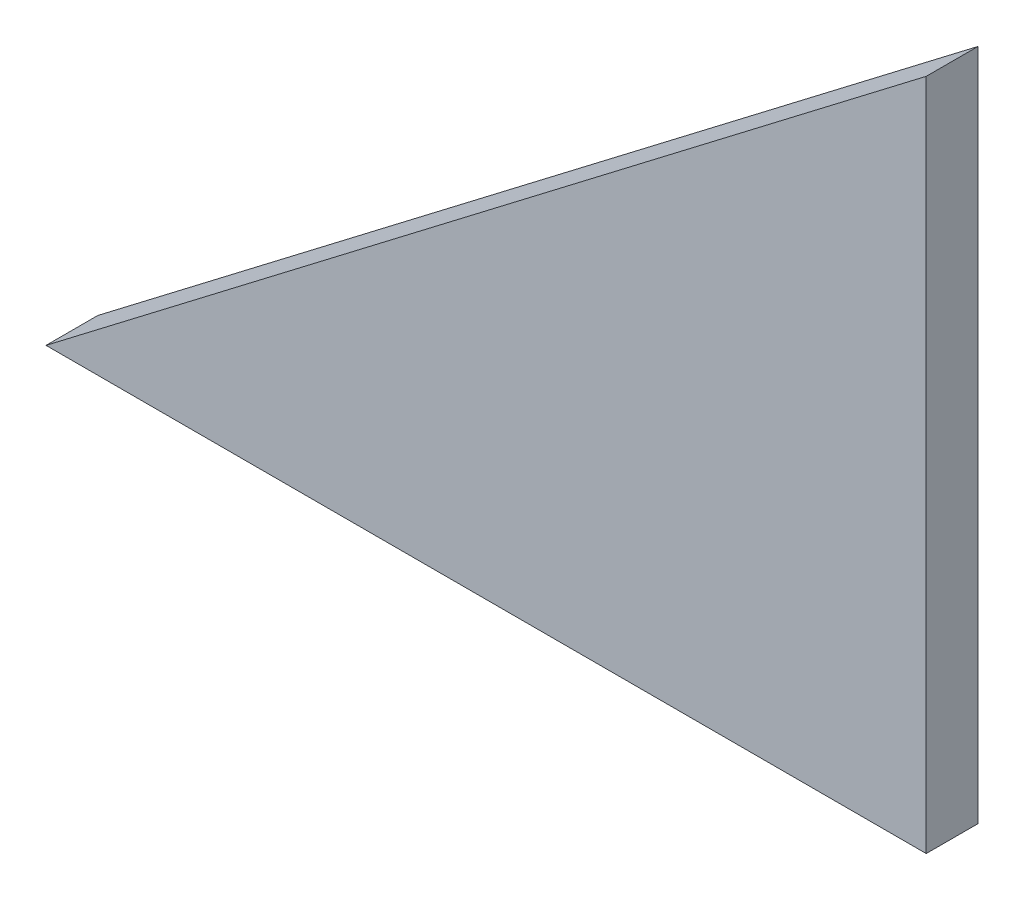
ISO-10303-21;
HEADER;
FILE_DESCRIPTION(('STEP AP214'),'2;1');
FILE_NAME('part.step','',(''),(''),'','','');
FILE_SCHEMA(('AUTOMOTIVE_DESIGN { 1 0 10303 214 1 1 1 1 }'));
ENDSEC;
DATA;
#1=APPLICATION_CONTEXT('core data for automotive mechanical design processes');
#2=APPLICATION_PROTOCOL_DEFINITION('international standard','automotive_design',2000,#1);
#3=PRODUCT_CONTEXT('',#1,'mechanical');
#4=PRODUCT('Part','Part','',(#3));
#5=PRODUCT_RELATED_PRODUCT_CATEGORY('part','',(#4));
#6=PRODUCT_DEFINITION_FORMATION('','',#4);
#7=PRODUCT_DEFINITION_CONTEXT('part definition',#1,'design');
#8=PRODUCT_DEFINITION('design','',#6,#7);
#9=PRODUCT_DEFINITION_SHAPE('','',#8);
#10=(LENGTH_UNIT() NAMED_UNIT(*) SI_UNIT(.MILLI.,.METRE.));
#11=(NAMED_UNIT(*) PLANE_ANGLE_UNIT() SI_UNIT($,.RADIAN.));
#12=(NAMED_UNIT(*) SI_UNIT($,.STERADIAN.) SOLID_ANGLE_UNIT());
#13=UNCERTAINTY_MEASURE_WITH_UNIT(LENGTH_MEASURE(1.E-05),#10,'distance_accuracy_value','');
#14=(GEOMETRIC_REPRESENTATION_CONTEXT(3) GLOBAL_UNCERTAINTY_ASSIGNED_CONTEXT((#13)) GLOBAL_UNIT_ASSIGNED_CONTEXT((#10,
#11,#12)) REPRESENTATION_CONTEXT('',''));
#15=CARTESIAN_POINT('',(0.,0.,0.));
#16=DIRECTION('',(0.,0.,1.));
#17=DIRECTION('',(1.,0.,0.));
#18=AXIS2_PLACEMENT_3D('',#15,#16,#17);
#19=CARTESIAN_POINT('',(170.,130.,-10.));
#20=DIRECTION('',(-0.607450107570797,0.794357832977196,0.));
#21=DIRECTION('',(-0.794357832977196,-0.607450107570797,0.));
#22=AXIS2_PLACEMENT_3D('',#19,#20,#21);
#23=PLANE('',#22);
#24=DIRECTION('',(-0.794357832977196,-0.607450107570797,0.));
#25=VECTOR('',#24,1.);
#26=CARTESIAN_POINT('',(170.,130.,0.));
#27=LINE('',#26,#25);
#28=CARTESIAN_POINT('',(170.,130.,0.));
#29=VERTEX_POINT('',#28);
#30=CARTESIAN_POINT('',(0.,0.,0.));
#31=VERTEX_POINT('',#30);
#32=EDGE_CURVE('E90',#29,#31,#27,.T.);
#33=ORIENTED_EDGE('',*,*,#32,.F.);
#34=DIRECTION('',(0.,0.,1.));
#35=VECTOR('',#34,1.);
#36=CARTESIAN_POINT('',(170.,130.,-10.));
#37=LINE('',#36,#35);
#38=CARTESIAN_POINT('',(170.,130.,-10.));
#39=VERTEX_POINT('',#38);
#40=EDGE_CURVE('E11',#39,#29,#37,.T.);
#41=ORIENTED_EDGE('',*,*,#40,.F.);
#42=DIRECTION('',(-0.794357832977196,-0.607450107570797,0.));
#43=VECTOR('',#42,1.);
#44=CARTESIAN_POINT('',(170.,130.,-10.));
#45=LINE('',#44,#43);
#46=CARTESIAN_POINT('',(0.,0.,-10.));
#47=VERTEX_POINT('',#46);
#48=EDGE_CURVE('E82',#39,#47,#45,.T.);
#49=ORIENTED_EDGE('',*,*,#48,.T.);
#50=DIRECTION('',(0.,0.,1.));
#51=VECTOR('',#50,1.);
#52=CARTESIAN_POINT('',(0.,0.,-10.));
#53=LINE('',#52,#51);
#54=EDGE_CURVE('E41',#47,#31,#53,.T.);
#55=ORIENTED_EDGE('',*,*,#54,.T.);
#56=EDGE_LOOP('',(#33,#41,#49,#55));
#57=FACE_BOUND('',#56,.T.);
#58=ADVANCED_FACE('F38',(#57),#23,.T.);
#59=CARTESIAN_POINT('',(170.,0.,-10.));
#60=DIRECTION('',(1.,0.,0.));
#61=DIRECTION('',(0.,0.,-1.));
#62=AXIS2_PLACEMENT_3D('',#59,#60,#61);
#63=PLANE('',#62);
#64=DIRECTION('',(0.,1.,0.));
#65=VECTOR('',#64,1.);
#66=CARTESIAN_POINT('',(170.,0.,0.));
#67=LINE('',#66,#65);
#68=CARTESIAN_POINT('',(170.,0.,0.));
#69=VERTEX_POINT('',#68);
#70=EDGE_CURVE('E84',#69,#29,#67,.T.);
#71=ORIENTED_EDGE('',*,*,#70,.F.);
#72=DIRECTION('',(0.,0.,1.));
#73=VECTOR('',#72,1.);
#74=CARTESIAN_POINT('',(170.,0.,-10.));
#75=LINE('',#74,#73);
#76=CARTESIAN_POINT('',(170.,0.,-10.));
#77=VERTEX_POINT('',#76);
#78=EDGE_CURVE('E47',#77,#69,#75,.T.);
#79=ORIENTED_EDGE('',*,*,#78,.F.);
#80=DIRECTION('',(0.,1.,0.));
#81=VECTOR('',#80,1.);
#82=CARTESIAN_POINT('',(170.,0.,-10.));
#83=LINE('',#82,#81);
#84=EDGE_CURVE('E79',#77,#39,#83,.T.);
#85=ORIENTED_EDGE('',*,*,#84,.T.);
#86=ORIENTED_EDGE('',*,*,#40,.T.);
#87=EDGE_LOOP('',(#71,#79,#85,#86));
#88=FACE_BOUND('',#87,.T.);
#89=ADVANCED_FACE('F94',(#88),#63,.T.);
#90=CARTESIAN_POINT('',(0.,0.,-10.));
#91=DIRECTION('',(0.,-1.,0.));
#92=DIRECTION('',(0.,0.,-1.));
#93=AXIS2_PLACEMENT_3D('',#90,#91,#92);
#94=PLANE('',#93);
#95=DIRECTION('',(1.,0.,0.));
#96=VECTOR('',#95,1.);
#97=CARTESIAN_POINT('',(0.,0.,0.));
#98=LINE('',#97,#96);
#99=EDGE_CURVE('E77',#31,#69,#98,.T.);
#100=ORIENTED_EDGE('',*,*,#99,.F.);
#101=ORIENTED_EDGE('',*,*,#54,.F.);
#102=DIRECTION('',(1.,0.,0.));
#103=VECTOR('',#102,1.);
#104=CARTESIAN_POINT('',(0.,0.,-10.));
#105=LINE('',#104,#103);
#106=EDGE_CURVE('E75',#47,#77,#105,.T.);
#107=ORIENTED_EDGE('',*,*,#106,.T.);
#108=ORIENTED_EDGE('',*,*,#78,.T.);
#109=EDGE_LOOP('',(#100,#101,#107,#108));
#110=FACE_BOUND('',#109,.T.);
#111=ADVANCED_FACE('F74',(#110),#94,.T.);
#112=CARTESIAN_POINT('',(0.,0.,-10.));
#113=DIRECTION('',(0.,0.,-1.));
#114=DIRECTION('',(-1.,0.,0.));
#115=AXIS2_PLACEMENT_3D('',#112,#113,#114);
#116=PLANE('',#115);
#117=ORIENTED_EDGE('',*,*,#48,.F.);
#118=ORIENTED_EDGE('',*,*,#84,.F.);
#119=ORIENTED_EDGE('',*,*,#106,.F.);
#120=EDGE_LOOP('',(#117,#118,#119));
#121=FACE_BOUND('',#120,.T.);
#122=ADVANCED_FACE('F81',(#121),#116,.T.);
#123=CARTESIAN_POINT('',(0.,0.,0.));
#124=DIRECTION('',(0.,0.,-1.));
#125=DIRECTION('',(-1.,0.,0.));
#126=AXIS2_PLACEMENT_3D('',#123,#124,#125);
#127=PLANE('',#126);
#128=ORIENTED_EDGE('',*,*,#32,.T.);
#129=ORIENTED_EDGE('',*,*,#99,.T.);
#130=ORIENTED_EDGE('',*,*,#70,.T.);
#131=EDGE_LOOP('',(#128,#129,#130));
#132=FACE_BOUND('',#131,.T.);
#133=ADVANCED_FACE('F93',(#132),#127,.F.);
#134=CLOSED_SHELL('',(#58,#89,#111,#122,#133));
#135=MANIFOLD_SOLID_BREP('B2',#134);
#136=ADVANCED_BREP_SHAPE_REPRESENTATION('',(#18,#135),#14);
#137=SHAPE_DEFINITION_REPRESENTATION(#9,#136);
ENDSEC;
END-ISO-10303-21;
